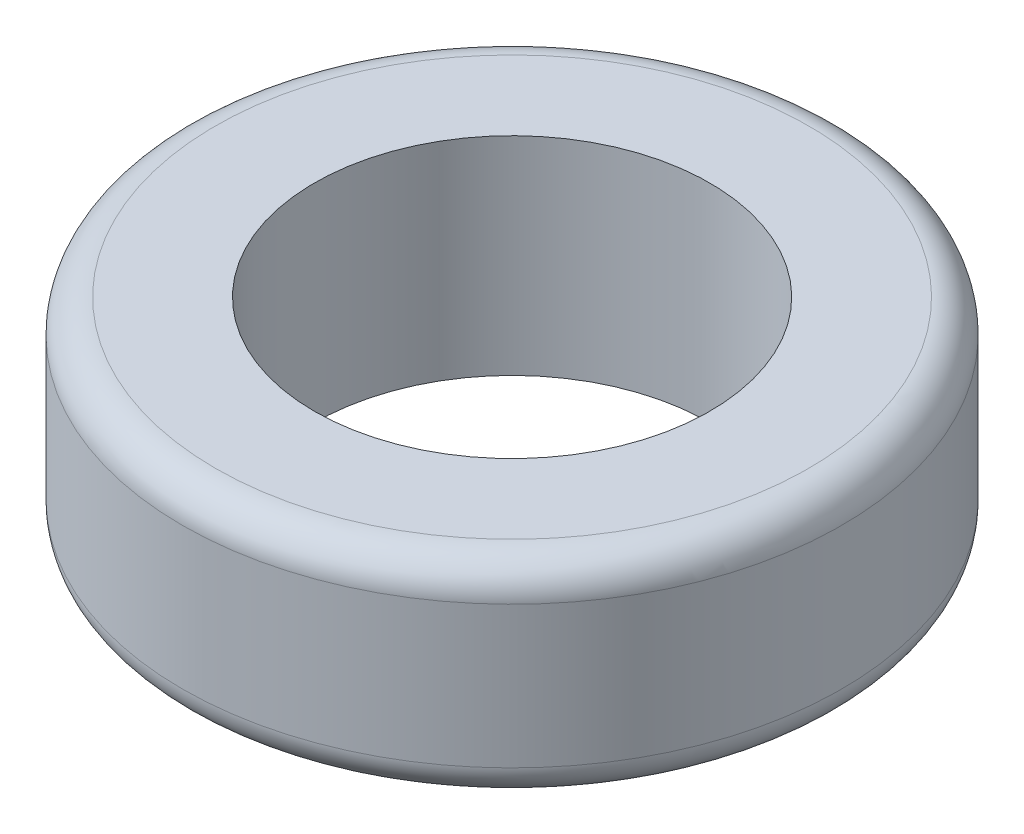
ISO-10303-21;
HEADER;
FILE_DESCRIPTION(('STEP AP214'),'2;1');
FILE_NAME('part.step','',(''),(''),'','','');
FILE_SCHEMA(('AUTOMOTIVE_DESIGN { 1 0 10303 214 1 1 1 1 }'));
ENDSEC;
DATA;
#1=APPLICATION_CONTEXT('core data for automotive mechanical design processes');
#2=APPLICATION_PROTOCOL_DEFINITION('international standard','automotive_design',2000,#1);
#3=PRODUCT_CONTEXT('',#1,'mechanical');
#4=PRODUCT('Part','Part','',(#3));
#5=PRODUCT_RELATED_PRODUCT_CATEGORY('part','',(#4));
#6=PRODUCT_DEFINITION_FORMATION('','',#4);
#7=PRODUCT_DEFINITION_CONTEXT('part definition',#1,'design');
#8=PRODUCT_DEFINITION('design','',#6,#7);
#9=PRODUCT_DEFINITION_SHAPE('','',#8);
#10=(LENGTH_UNIT() NAMED_UNIT(*) SI_UNIT(.MILLI.,.METRE.));
#11=(NAMED_UNIT(*) PLANE_ANGLE_UNIT() SI_UNIT($,.RADIAN.));
#12=(NAMED_UNIT(*) SI_UNIT($,.STERADIAN.) SOLID_ANGLE_UNIT());
#13=UNCERTAINTY_MEASURE_WITH_UNIT(LENGTH_MEASURE(1.E-05),#10,'distance_accuracy_value','');
#14=(GEOMETRIC_REPRESENTATION_CONTEXT(3) GLOBAL_UNCERTAINTY_ASSIGNED_CONTEXT((#13)) GLOBAL_UNIT_ASSIGNED_CONTEXT((#10,
#11,#12)) REPRESENTATION_CONTEXT('',''));
#15=CARTESIAN_POINT('',(0.,0.,0.));
#16=DIRECTION('',(0.,0.,1.));
#17=DIRECTION('',(1.,0.,0.));
#18=AXIS2_PLACEMENT_3D('',#15,#16,#17);
#19=CARTESIAN_POINT('',(0.,6.3,0.));
#20=DIRECTION('',(0.,1.,0.));
#21=DIRECTION('',(0.,0.,1.));
#22=AXIS2_PLACEMENT_3D('',#19,#20,#21);
#23=PLANE('',#22);
#24=CARTESIAN_POINT('',(0.,6.3,0.));
#25=DIRECTION('',(0.,1.,0.));
#26=DIRECTION('',(0.,0.,1.));
#27=AXIS2_PLACEMENT_3D('',#24,#25,#26);
#28=CIRCLE('',#27,9.);
#29=CARTESIAN_POINT('',(0.,6.3,9.));
#30=VERTEX_POINT('',#29);
#31=EDGE_CURVE('E10',#30,#30,#28,.T.);
#32=ORIENTED_EDGE('',*,*,#31,.T.);
#33=EDGE_LOOP('',(#32));
#34=FACE_BOUND('',#33,.T.);
#35=CARTESIAN_POINT('',(0.,6.3,0.));
#36=DIRECTION('',(0.,1.,0.));
#37=DIRECTION('',(0.,0.,1.));
#38=AXIS2_PLACEMENT_3D('',#35,#36,#37);
#39=CIRCLE('',#38,6.);
#40=CARTESIAN_POINT('',(0.,6.3,6.));
#41=VERTEX_POINT('',#40);
#42=EDGE_CURVE('E61',#41,#41,#39,.T.);
#43=ORIENTED_EDGE('',*,*,#42,.F.);
#44=EDGE_LOOP('',(#43));
#45=FACE_BOUND('',#44,.T.);
#46=ADVANCED_FACE('F37',(#34,#45),#23,.T.);
#47=CARTESIAN_POINT('',(0.,0.,0.));
#48=DIRECTION('',(0.,1.,0.));
#49=DIRECTION('',(0.,0.,1.));
#50=AXIS2_PLACEMENT_3D('',#47,#48,#49);
#51=PLANE('',#50);
#52=CARTESIAN_POINT('',(0.,0.,0.));
#53=DIRECTION('',(0.,1.,0.));
#54=DIRECTION('',(0.,0.,1.));
#55=AXIS2_PLACEMENT_3D('',#52,#53,#54);
#56=CIRCLE('',#55,9.);
#57=CARTESIAN_POINT('',(0.,0.,9.));
#58=VERTEX_POINT('',#57);
#59=EDGE_CURVE('E45',#58,#58,#56,.F.);
#60=ORIENTED_EDGE('',*,*,#59,.T.);
#61=EDGE_LOOP('',(#60));
#62=FACE_BOUND('',#61,.T.);
#63=CARTESIAN_POINT('',(0.,0.,0.));
#64=DIRECTION('',(0.,1.,0.));
#65=DIRECTION('',(0.,0.,1.));
#66=AXIS2_PLACEMENT_3D('',#63,#64,#65);
#67=CIRCLE('',#66,6.);
#68=CARTESIAN_POINT('',(0.,0.,6.));
#69=VERTEX_POINT('',#68);
#70=EDGE_CURVE('E62',#69,#69,#67,.T.);
#71=ORIENTED_EDGE('',*,*,#70,.T.);
#72=EDGE_LOOP('',(#71));
#73=FACE_BOUND('',#72,.T.);
#74=ADVANCED_FACE('F74',(#62,#73),#51,.F.);
#75=CARTESIAN_POINT('',(0.,6.3,0.));
#76=DIRECTION('',(0.,-1.,0.));
#77=DIRECTION('',(0.,0.,-1.));
#78=AXIS2_PLACEMENT_3D('',#75,#76,#77);
#79=CYLINDRICAL_SURFACE('',#78,10.);
#80=CARTESIAN_POINT('',(0.,1.,0.));
#81=DIRECTION('',(0.,1.,0.));
#82=DIRECTION('',(0.,0.,1.));
#83=AXIS2_PLACEMENT_3D('',#80,#81,#82);
#84=CIRCLE('',#83,10.);
#85=CARTESIAN_POINT('',(0.,1.,10.));
#86=VERTEX_POINT('',#85);
#87=EDGE_CURVE('E50',#86,#86,#84,.T.);
#88=ORIENTED_EDGE('',*,*,#87,.T.);
#89=EDGE_LOOP('',(#88));
#90=FACE_BOUND('',#89,.T.);
#91=CARTESIAN_POINT('',(0.,5.3,0.));
#92=DIRECTION('',(0.,1.,0.));
#93=DIRECTION('',(0.,0.,1.));
#94=AXIS2_PLACEMENT_3D('',#91,#92,#93);
#95=CIRCLE('',#94,10.);
#96=CARTESIAN_POINT('',(0.,5.3,10.));
#97=VERTEX_POINT('',#96);
#98=EDGE_CURVE('E55',#97,#97,#95,.F.);
#99=ORIENTED_EDGE('',*,*,#98,.T.);
#100=EDGE_LOOP('',(#99));
#101=FACE_BOUND('',#100,.T.);
#102=ADVANCED_FACE('F79',(#90,#101),#79,.T.);
#103=CARTESIAN_POINT('',(0.,6.3,0.));
#104=DIRECTION('',(0.,-1.,0.));
#105=DIRECTION('',(0.,0.,-1.));
#106=AXIS2_PLACEMENT_3D('',#103,#104,#105);
#107=CYLINDRICAL_SURFACE('',#106,6.);
#108=ORIENTED_EDGE('',*,*,#42,.T.);
#109=EDGE_LOOP('',(#108));
#110=FACE_BOUND('',#109,.T.);
#111=ORIENTED_EDGE('',*,*,#70,.F.);
#112=EDGE_LOOP('',(#111));
#113=FACE_BOUND('',#112,.T.);
#114=ADVANCED_FACE('F70',(#110,#113),#107,.F.);
#115=CARTESIAN_POINT('',(0.,1.,0.));
#116=DIRECTION('',(0.,1.,0.));
#117=DIRECTION('',(0.,0.,1.));
#118=AXIS2_PLACEMENT_3D('',#115,#116,#117);
#119=TOROIDAL_SURFACE('',#118,9.,1.);
#120=ORIENTED_EDGE('',*,*,#59,.F.);
#121=EDGE_LOOP('',(#120));
#122=FACE_BOUND('',#121,.T.);
#123=ORIENTED_EDGE('',*,*,#87,.F.);
#124=EDGE_LOOP('',(#123));
#125=FACE_BOUND('',#124,.T.);
#126=ADVANCED_FACE('F85',(#122,#125),#119,.T.);
#127=CARTESIAN_POINT('',(0.,5.3,0.));
#128=DIRECTION('',(0.,1.,0.));
#129=DIRECTION('',(0.,0.,1.));
#130=AXIS2_PLACEMENT_3D('',#127,#128,#129);
#131=TOROIDAL_SURFACE('',#130,9.,1.);
#132=ORIENTED_EDGE('',*,*,#98,.F.);
#133=EDGE_LOOP('',(#132));
#134=FACE_BOUND('',#133,.T.);
#135=ORIENTED_EDGE('',*,*,#31,.F.);
#136=EDGE_LOOP('',(#135));
#137=FACE_BOUND('',#136,.T.);
#138=ADVANCED_FACE('F39',(#134,#137),#131,.T.);
#139=CLOSED_SHELL('',(#46,#74,#102,#114,#126,#138));
#140=MANIFOLD_SOLID_BREP('B2',#139);
#141=ADVANCED_BREP_SHAPE_REPRESENTATION('',(#18,#140),#14);
#142=SHAPE_DEFINITION_REPRESENTATION(#9,#141);
ENDSEC;
END-ISO-10303-21;
